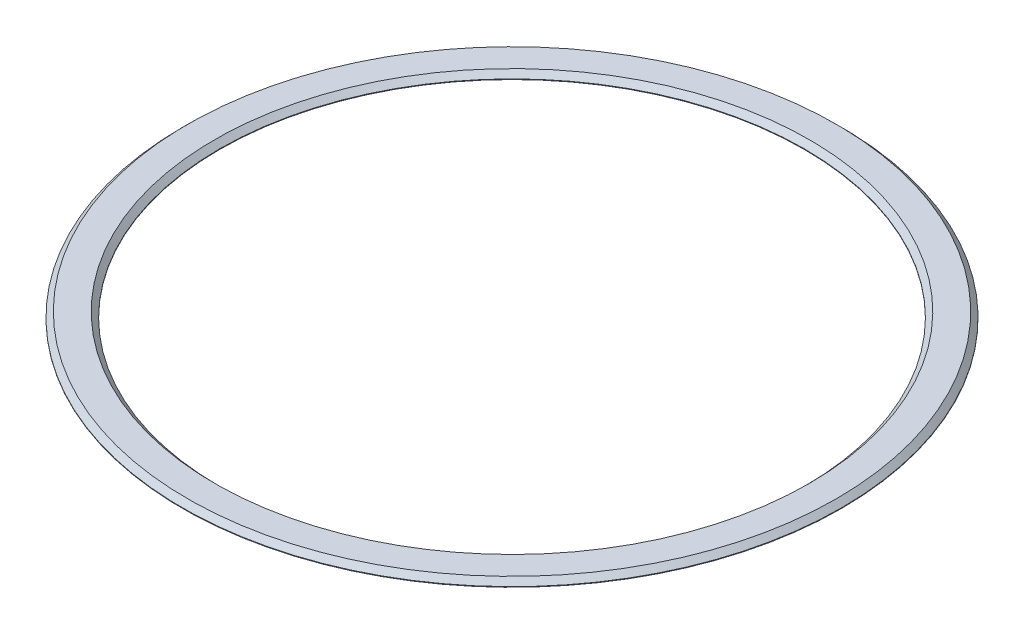
ISO-10303-21;
HEADER;
FILE_DESCRIPTION(('STEP AP214'),'2;1');
FILE_NAME('part.step','',(''),(''),'','','');
FILE_SCHEMA(('AUTOMOTIVE_DESIGN { 1 0 10303 214 1 1 1 1 }'));
ENDSEC;
DATA;
#1=APPLICATION_CONTEXT('core data for automotive mechanical design processes');
#2=APPLICATION_PROTOCOL_DEFINITION('international standard','automotive_design',2000,#1);
#3=PRODUCT_CONTEXT('',#1,'mechanical');
#4=PRODUCT('Part','Part','',(#3));
#5=PRODUCT_RELATED_PRODUCT_CATEGORY('part','',(#4));
#6=PRODUCT_DEFINITION_FORMATION('','',#4);
#7=PRODUCT_DEFINITION_CONTEXT('part definition',#1,'design');
#8=PRODUCT_DEFINITION('design','',#6,#7);
#9=PRODUCT_DEFINITION_SHAPE('','',#8);
#10=(LENGTH_UNIT() NAMED_UNIT(*) SI_UNIT(.MILLI.,.METRE.));
#11=(NAMED_UNIT(*) PLANE_ANGLE_UNIT() SI_UNIT($,.RADIAN.));
#12=(NAMED_UNIT(*) SI_UNIT($,.STERADIAN.) SOLID_ANGLE_UNIT());
#13=UNCERTAINTY_MEASURE_WITH_UNIT(LENGTH_MEASURE(1.E-05),#10,'distance_accuracy_value','');
#14=(GEOMETRIC_REPRESENTATION_CONTEXT(3) GLOBAL_UNCERTAINTY_ASSIGNED_CONTEXT((#13)) GLOBAL_UNIT_ASSIGNED_CONTEXT((#10,
#11,#12)) REPRESENTATION_CONTEXT('',''));
#15=CARTESIAN_POINT('',(0.,0.,0.));
#16=DIRECTION('',(0.,0.,1.));
#17=DIRECTION('',(1.,0.,0.));
#18=AXIS2_PLACEMENT_3D('',#15,#16,#17);
#19=CARTESIAN_POINT('',(0.,10.2,0.));
#20=DIRECTION('',(0.,-1.,0.));
#21=DIRECTION('',(1.,0.,0.));
#22=AXIS2_PLACEMENT_3D('',#19,#20,#21);
#23=CONICAL_SURFACE('',#22,111.96074369328,0.785398163397447);
#24=CARTESIAN_POINT('',(0.,8.40000000000001,0.));
#25=DIRECTION('',(0.,-1.,0.));
#26=DIRECTION('',(1.,0.,0.));
#27=AXIS2_PLACEMENT_3D('',#24,#25,#26);
#28=CIRCLE('',#27,113.76074369328);
#29=CARTESIAN_POINT('',(113.76074369328,8.40000000000003,0.));
#30=VERTEX_POINT('',#29);
#31=EDGE_CURVE('E55',#30,#30,#28,.T.);
#32=ORIENTED_EDGE('',*,*,#31,.F.);
#33=EDGE_LOOP('',(#32));
#34=FACE_BOUND('',#33,.T.);
#35=CARTESIAN_POINT('',(0.,10.2,0.));
#36=DIRECTION('',(0.,-1.,0.));
#37=DIRECTION('',(1.,0.,0.));
#38=AXIS2_PLACEMENT_3D('',#35,#36,#37);
#39=CIRCLE('',#38,111.96074369328);
#40=CARTESIAN_POINT('',(111.96074369328,10.2,0.));
#41=VERTEX_POINT('',#40);
#42=EDGE_CURVE('E10',#41,#41,#39,.T.);
#43=ORIENTED_EDGE('',*,*,#42,.T.);
#44=EDGE_LOOP('',(#43));
#45=FACE_BOUND('',#44,.T.);
#46=ADVANCED_FACE('F33',(#34,#45),#23,.T.);
#47=CARTESIAN_POINT('',(-111.96074369328,10.2,0.));
#48=DIRECTION('',(0.,-1.,0.));
#49=DIRECTION('',(1.,0.,0.));
#50=AXIS2_PLACEMENT_3D('',#47,#48,#49);
#51=PLANE('',#50);
#52=ORIENTED_EDGE('',*,*,#42,.F.);
#53=EDGE_LOOP('',(#52));
#54=FACE_BOUND('',#53,.T.);
#55=CARTESIAN_POINT('',(0.,10.2,0.));
#56=DIRECTION('',(0.,-1.,0.));
#57=DIRECTION('',(1.,0.,0.));
#58=AXIS2_PLACEMENT_3D('',#55,#56,#57);
#59=CIRCLE('',#58,102.710512846744);
#60=CARTESIAN_POINT('',(102.710512846744,10.2,0.));
#61=VERTEX_POINT('',#60);
#62=EDGE_CURVE('E39',#61,#61,#59,.T.);
#63=ORIENTED_EDGE('',*,*,#62,.T.);
#64=EDGE_LOOP('',(#63));
#65=FACE_BOUND('',#64,.T.);
#66=ADVANCED_FACE('F62',(#54,#65),#51,.F.);
#67=CARTESIAN_POINT('',(0.,8.40000000000001,0.));
#68=DIRECTION('',(0.,1.,0.));
#69=DIRECTION('',(-1.,0.,0.));
#70=AXIS2_PLACEMENT_3D('',#67,#68,#69);
#71=CONICAL_SURFACE('',#70,100.910512846744,0.785398163397447);
#72=ORIENTED_EDGE('',*,*,#62,.F.);
#73=EDGE_LOOP('',(#72));
#74=FACE_BOUND('',#73,.T.);
#75=CARTESIAN_POINT('',(0.,8.40000000000001,0.));
#76=DIRECTION('',(0.,-1.,0.));
#77=DIRECTION('',(1.,0.,0.));
#78=AXIS2_PLACEMENT_3D('',#75,#76,#77);
#79=CIRCLE('',#78,100.910512846744);
#80=CARTESIAN_POINT('',(100.910512846744,8.40000000000002,0.));
#81=VERTEX_POINT('',#80);
#82=EDGE_CURVE('E43',#81,#81,#79,.T.);
#83=ORIENTED_EDGE('',*,*,#82,.T.);
#84=EDGE_LOOP('',(#83));
#85=FACE_BOUND('',#84,.T.);
#86=ADVANCED_FACE('F66',(#74,#85),#71,.F.);
#87=CARTESIAN_POINT('',(0.,0.,0.));
#88=DIRECTION('',(0.,-1.,0.));
#89=DIRECTION('',(1.,0.,0.));
#90=AXIS2_PLACEMENT_3D('',#87,#88,#89);
#91=CYLINDRICAL_SURFACE('',#90,100.910512846744);
#92=ORIENTED_EDGE('',*,*,#82,.F.);
#93=EDGE_LOOP('',(#92));
#94=FACE_BOUND('',#93,.T.);
#95=CARTESIAN_POINT('',(0.,8.20000000000001,0.));
#96=DIRECTION('',(0.,-1.,0.));
#97=DIRECTION('',(1.,0.,0.));
#98=AXIS2_PLACEMENT_3D('',#95,#96,#97);
#99=CIRCLE('',#98,100.910512846744);
#100=CARTESIAN_POINT('',(100.910512846744,8.20000000000002,0.));
#101=VERTEX_POINT('',#100);
#102=EDGE_CURVE('E47',#101,#101,#99,.T.);
#103=ORIENTED_EDGE('',*,*,#102,.T.);
#104=EDGE_LOOP('',(#103));
#105=FACE_BOUND('',#104,.T.);
#106=ADVANCED_FACE('F71',(#94,#105),#91,.F.);
#107=CARTESIAN_POINT('',(-113.76074369328,8.2,0.));
#108=DIRECTION('',(0.,1.,0.));
#109=DIRECTION('',(-1.,0.,0.));
#110=AXIS2_PLACEMENT_3D('',#107,#108,#109);
#111=PLANE('',#110);
#112=ORIENTED_EDGE('',*,*,#102,.F.);
#113=EDGE_LOOP('',(#112));
#114=FACE_BOUND('',#113,.T.);
#115=CARTESIAN_POINT('',(0.,8.20000000000001,0.));
#116=DIRECTION('',(0.,-1.,0.));
#117=DIRECTION('',(1.,0.,0.));
#118=AXIS2_PLACEMENT_3D('',#115,#116,#117);
#119=CIRCLE('',#118,113.76074369328);
#120=CARTESIAN_POINT('',(113.76074369328,8.20000000000003,0.));
#121=VERTEX_POINT('',#120);
#122=EDGE_CURVE('E52',#121,#121,#119,.T.);
#123=ORIENTED_EDGE('',*,*,#122,.T.);
#124=EDGE_LOOP('',(#123));
#125=FACE_BOUND('',#124,.T.);
#126=ADVANCED_FACE('F77',(#114,#125),#111,.F.);
#127=CARTESIAN_POINT('',(0.,0.,0.));
#128=DIRECTION('',(0.,-1.,0.));
#129=DIRECTION('',(1.,0.,0.));
#130=AXIS2_PLACEMENT_3D('',#127,#128,#129);
#131=CYLINDRICAL_SURFACE('',#130,113.76074369328);
#132=ORIENTED_EDGE('',*,*,#122,.F.);
#133=EDGE_LOOP('',(#132));
#134=FACE_BOUND('',#133,.T.);
#135=ORIENTED_EDGE('',*,*,#31,.T.);
#136=EDGE_LOOP('',(#135));
#137=FACE_BOUND('',#136,.T.);
#138=ADVANCED_FACE('F59',(#134,#137),#131,.T.);
#139=CLOSED_SHELL('',(#46,#66,#86,#106,#126,#138));
#140=MANIFOLD_SOLID_BREP('B2',#139);
#141=ADVANCED_BREP_SHAPE_REPRESENTATION('',(#18,#140),#14);
#142=SHAPE_DEFINITION_REPRESENTATION(#9,#141);
ENDSEC;
END-ISO-10303-21;
